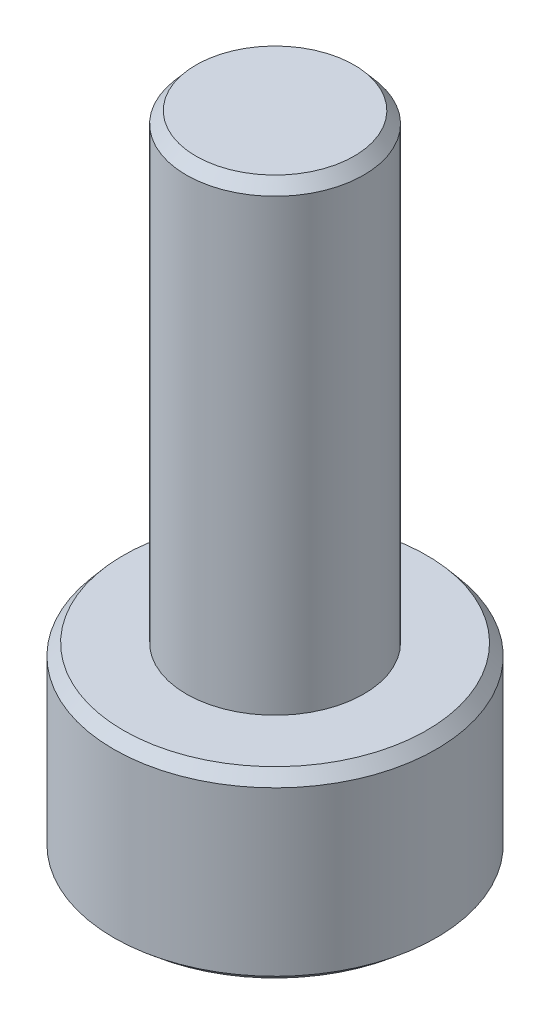
ISO-10303-21;
HEADER;
FILE_DESCRIPTION(('STEP AP214'),'2;1');
FILE_NAME('part.step','',(''),(''),'','','');
FILE_SCHEMA(('AUTOMOTIVE_DESIGN { 1 0 10303 214 1 1 1 1 }'));
ENDSEC;
DATA;
#1=APPLICATION_CONTEXT('core data for automotive mechanical design processes');
#2=APPLICATION_PROTOCOL_DEFINITION('international standard','automotive_design',2000,#1);
#3=PRODUCT_CONTEXT('',#1,'mechanical');
#4=PRODUCT('Part','Part','',(#3));
#5=PRODUCT_RELATED_PRODUCT_CATEGORY('part','',(#4));
#6=PRODUCT_DEFINITION_FORMATION('','',#4);
#7=PRODUCT_DEFINITION_CONTEXT('part definition',#1,'design');
#8=PRODUCT_DEFINITION('design','',#6,#7);
#9=PRODUCT_DEFINITION_SHAPE('','',#8);
#10=(LENGTH_UNIT() NAMED_UNIT(*) SI_UNIT(.MILLI.,.METRE.));
#11=(NAMED_UNIT(*) PLANE_ANGLE_UNIT() SI_UNIT($,.RADIAN.));
#12=(NAMED_UNIT(*) SI_UNIT($,.STERADIAN.) SOLID_ANGLE_UNIT());
#13=UNCERTAINTY_MEASURE_WITH_UNIT(LENGTH_MEASURE(1.E-05),#10,'distance_accuracy_value','');
#14=(GEOMETRIC_REPRESENTATION_CONTEXT(3) GLOBAL_UNCERTAINTY_ASSIGNED_CONTEXT((#13)) GLOBAL_UNIT_ASSIGNED_CONTEXT((#10,
#11,#12)) REPRESENTATION_CONTEXT('',''));
#15=CARTESIAN_POINT('',(0.,0.,0.));
#16=DIRECTION('',(0.,0.,1.));
#17=DIRECTION('',(1.,0.,0.));
#18=AXIS2_PLACEMENT_3D('',#15,#16,#17);
#19=CARTESIAN_POINT('',(0.,4.,0.));
#20=DIRECTION('',(0.,-1.,0.));
#21=DIRECTION('',(0.,0.,-1.));
#22=AXIS2_PLACEMENT_3D('',#19,#20,#21);
#23=CYLINDRICAL_SURFACE('',#22,3.5);
#24=CARTESIAN_POINT('',(0.,0.209774907794321,0.));
#25=DIRECTION('',(0.,1.,0.));
#26=DIRECTION('',(0.,0.,1.));
#27=AXIS2_PLACEMENT_3D('',#24,#25,#26);
#28=CIRCLE('',#27,3.5);
#29=CARTESIAN_POINT('',(0.,0.209774907794321,3.5));
#30=VERTEX_POINT('',#29);
#31=EDGE_CURVE('E203',#30,#30,#28,.T.);
#32=ORIENTED_EDGE('',*,*,#31,.T.);
#33=EDGE_LOOP('',(#32));
#34=FACE_BOUND('',#33,.T.);
#35=CARTESIAN_POINT('',(0.,3.75,0.));
#36=DIRECTION('',(0.,1.,0.));
#37=DIRECTION('',(0.,0.,1.));
#38=AXIS2_PLACEMENT_3D('',#35,#36,#37);
#39=CIRCLE('',#38,3.5);
#40=CARTESIAN_POINT('',(0.,3.75,3.5));
#41=VERTEX_POINT('',#40);
#42=EDGE_CURVE('E200',#41,#41,#39,.F.);
#43=ORIENTED_EDGE('',*,*,#42,.T.);
#44=EDGE_LOOP('',(#43));
#45=FACE_BOUND('',#44,.T.);
#46=ADVANCED_FACE('F45',(#34,#45),#23,.T.);
#47=CARTESIAN_POINT('',(0.,4.,0.));
#48=DIRECTION('',(0.,1.,0.));
#49=DIRECTION('',(0.,0.,1.));
#50=AXIS2_PLACEMENT_3D('',#47,#48,#49);
#51=PLANE('',#50);
#52=CARTESIAN_POINT('',(0.,4.,0.));
#53=DIRECTION('',(0.,1.,0.));
#54=DIRECTION('',(0.,0.,1.));
#55=AXIS2_PLACEMENT_3D('',#52,#53,#54);
#56=CIRCLE('',#55,3.29022509220568);
#57=CARTESIAN_POINT('',(0.,4.,3.29022509220568));
#58=VERTEX_POINT('',#57);
#59=EDGE_CURVE('E207',#58,#58,#56,.T.);
#60=ORIENTED_EDGE('',*,*,#59,.T.);
#61=EDGE_LOOP('',(#60));
#62=FACE_BOUND('',#61,.T.);
#63=CARTESIAN_POINT('',(0.,4.,0.));
#64=DIRECTION('',(0.,1.,0.));
#65=DIRECTION('',(0.,0.,1.));
#66=AXIS2_PLACEMENT_3D('',#63,#64,#65);
#67=CIRCLE('',#66,1.925);
#68=CARTESIAN_POINT('',(0.,4.,1.925));
#69=VERTEX_POINT('',#68);
#70=EDGE_CURVE('E155',#69,#69,#67,.T.);
#71=ORIENTED_EDGE('',*,*,#70,.F.);
#72=EDGE_LOOP('',(#71));
#73=FACE_BOUND('',#72,.T.);
#74=ADVANCED_FACE('F264',(#62,#73),#51,.T.);
#75=CARTESIAN_POINT('',(0.,0.,0.));
#76=DIRECTION('',(0.,1.,0.));
#77=DIRECTION('',(0.,0.,1.));
#78=AXIS2_PLACEMENT_3D('',#75,#76,#77);
#79=PLANE('',#78);
#80=DIRECTION('',(-0.866025403784442,0.,0.499999999999995));
#81=VECTOR('',#80,1.);
#82=CARTESIAN_POINT('',(-1.15206434767624,0.,-1.99543398376396));
#83=LINE('',#82,#81);
#84=CARTESIAN_POINT('',(0.,0.,-2.66057864501861));
#85=VERTEX_POINT('',#84);
#86=CARTESIAN_POINT('',(-2.30412869535249,0.,-1.33028932250932));
#87=VERTEX_POINT('',#86);
#88=EDGE_CURVE('E185',#85,#87,#83,.T.);
#89=ORIENTED_EDGE('',*,*,#88,.T.);
#90=DIRECTION('',(0.,0.,1.));
#91=VECTOR('',#90,1.);
#92=CARTESIAN_POINT('',(-2.30412869535249,0.,0.));
#93=LINE('',#92,#91);
#94=CARTESIAN_POINT('',(-2.3041286953525,0.,1.3302893225093));
#95=VERTEX_POINT('',#94);
#96=EDGE_CURVE('E187',#87,#95,#93,.T.);
#97=ORIENTED_EDGE('',*,*,#96,.T.);
#98=DIRECTION('',(0.866025403784438,0.,0.500000000000001));
#99=VECTOR('',#98,1.);
#100=CARTESIAN_POINT('',(-1.15206434767625,0.,1.99543398376395));
#101=LINE('',#100,#99);
#102=CARTESIAN_POINT('',(0.,0.,2.66057864501861));
#103=VERTEX_POINT('',#102);
#104=EDGE_CURVE('E175',#95,#103,#101,.T.);
#105=ORIENTED_EDGE('',*,*,#104,.T.);
#106=DIRECTION('',(0.866025403784442,0.,-0.499999999999995));
#107=VECTOR('',#106,1.);
#108=CARTESIAN_POINT('',(1.15206434767624,0.,1.99543398376397));
#109=LINE('',#108,#107);
#110=CARTESIAN_POINT('',(2.30412869535248,0.,1.33028932250933));
#111=VERTEX_POINT('',#110);
#112=EDGE_CURVE('E177',#103,#111,#109,.T.);
#113=ORIENTED_EDGE('',*,*,#112,.T.);
#114=DIRECTION('',(0.,0.,-1.));
#115=VECTOR('',#114,1.);
#116=CARTESIAN_POINT('',(2.30412869535249,0.,0.));
#117=LINE('',#116,#115);
#118=CARTESIAN_POINT('',(2.30412869535251,0.,-1.33028932250928));
#119=VERTEX_POINT('',#118);
#120=EDGE_CURVE('E180',#111,#119,#117,.T.);
#121=ORIENTED_EDGE('',*,*,#120,.T.);
#122=DIRECTION('',(-0.866025403784434,0.,-0.500000000000007));
#123=VECTOR('',#122,1.);
#124=CARTESIAN_POINT('',(1.15206434767626,0.,-1.99543398376395));
#125=LINE('',#124,#123);
#126=EDGE_CURVE('E183',#119,#85,#125,.T.);
#127=ORIENTED_EDGE('',*,*,#126,.T.);
#128=EDGE_LOOP('',(#89,#97,#105,#113,#121,#127));
#129=FACE_BOUND('',#128,.T.);
#130=CARTESIAN_POINT('',(0.,0.,0.));
#131=DIRECTION('',(0.,1.,0.));
#132=DIRECTION('',(0.,0.,1.));
#133=AXIS2_PLACEMENT_3D('',#130,#131,#132);
#134=CIRCLE('',#133,3.25);
#135=CARTESIAN_POINT('',(0.,0.,3.25));
#136=VERTEX_POINT('',#135);
#137=EDGE_CURVE('E171',#136,#136,#134,.F.);
#138=ORIENTED_EDGE('',*,*,#137,.T.);
#139=EDGE_LOOP('',(#138));
#140=FACE_BOUND('',#139,.T.);
#141=ADVANCED_FACE('F272',(#129,#140),#79,.F.);
#142=CARTESIAN_POINT('',(0.,14.,0.));
#143=DIRECTION('',(0.,-1.,0.));
#144=DIRECTION('',(0.,0.,-1.));
#145=AXIS2_PLACEMENT_3D('',#142,#143,#144);
#146=CYLINDRICAL_SURFACE('',#145,1.925);
#147=CARTESIAN_POINT('',(0.,13.75,0.));
#148=DIRECTION('',(0.,1.,0.));
#149=DIRECTION('',(0.,0.,1.));
#150=AXIS2_PLACEMENT_3D('',#147,#148,#149);
#151=CIRCLE('',#150,1.925);
#152=CARTESIAN_POINT('',(0.,13.75,1.925));
#153=VERTEX_POINT('',#152);
#154=EDGE_CURVE('E11',#153,#153,#151,.F.);
#155=ORIENTED_EDGE('',*,*,#154,.T.);
#156=EDGE_LOOP('',(#155));
#157=FACE_BOUND('',#156,.T.);
#158=ORIENTED_EDGE('',*,*,#70,.T.);
#159=EDGE_LOOP('',(#158));
#160=FACE_BOUND('',#159,.T.);
#161=ADVANCED_FACE('F335',(#157,#160),#146,.T.);
#162=CARTESIAN_POINT('',(0.,14.,0.));
#163=DIRECTION('',(0.,1.,0.));
#164=DIRECTION('',(0.,0.,1.));
#165=AXIS2_PLACEMENT_3D('',#162,#163,#164);
#166=PLANE('',#165);
#167=CARTESIAN_POINT('',(0.,14.,0.));
#168=DIRECTION('',(0.,1.,0.));
#169=DIRECTION('',(0.,0.,1.));
#170=AXIS2_PLACEMENT_3D('',#167,#168,#169);
#171=CIRCLE('',#170,1.71522509220568);
#172=CARTESIAN_POINT('',(0.,14.,1.71522509220568));
#173=VERTEX_POINT('',#172);
#174=EDGE_CURVE('E55',#173,#173,#171,.T.);
#175=ORIENTED_EDGE('',*,*,#174,.T.);
#176=EDGE_LOOP('',(#175));
#177=FACE_BOUND('',#176,.T.);
#178=ADVANCED_FACE('F260',(#177),#166,.T.);
#179=CARTESIAN_POINT('',(2.05412869535248,2.,1.18595175521192));
#180=DIRECTION('',(0.499999999999995,0.,0.866025403784441));
#181=DIRECTION('',(0.866025403784442,0.,-0.499999999999995));
#182=AXIS2_PLACEMENT_3D('',#179,#180,#181);
#183=PLANE('',#182);
#184=DIRECTION('',(0.,-1.,0.));
#185=VECTOR('',#184,1.);
#186=CARTESIAN_POINT('',(2.05412869535248,2.,1.18595175521192));
#187=LINE('',#186,#185);
#188=CARTESIAN_POINT('',(2.05412869535248,2.,1.18595175521192));
#189=VERTEX_POINT('',#188);
#190=CARTESIAN_POINT('',(2.05412869535248,0.209774907794322,1.18595175521192));
#191=VERTEX_POINT('',#190);
#192=EDGE_CURVE('E153',#189,#191,#187,.T.);
#193=ORIENTED_EDGE('',*,*,#192,.T.);
#194=DIRECTION('',(-0.866025403784442,0.,0.499999999999995));
#195=VECTOR('',#194,1.);
#196=CARTESIAN_POINT('',(2.05412869535248,0.209774907794322,1.18595175521192));
#197=LINE('',#196,#195);
#198=CARTESIAN_POINT('',(0.,0.209774907794322,2.37190351042379));
#199=VERTEX_POINT('',#198);
#200=EDGE_CURVE('E63',#191,#199,#197,.T.);
#201=ORIENTED_EDGE('',*,*,#200,.T.);
#202=DIRECTION('',(0.,-1.,0.));
#203=VECTOR('',#202,1.);
#204=CARTESIAN_POINT('',(0.,2.,2.37190351042379));
#205=LINE('',#204,#203);
#206=CARTESIAN_POINT('',(0.,2.,2.37190351042379));
#207=VERTEX_POINT('',#206);
#208=EDGE_CURVE('E118',#207,#199,#205,.T.);
#209=ORIENTED_EDGE('',*,*,#208,.F.);
#210=DIRECTION('',(-0.866025403784441,0.,0.499999999999995));
#211=VECTOR('',#210,1.);
#212=CARTESIAN_POINT('',(2.05412869535248,2.,1.18595175521192));
#213=LINE('',#212,#211);
#214=EDGE_CURVE('E122',#189,#207,#213,.T.);
#215=ORIENTED_EDGE('',*,*,#214,.F.);
#216=EDGE_LOOP('',(#193,#201,#209,#215));
#217=FACE_BOUND('',#216,.T.);
#218=ADVANCED_FACE('F120',(#217),#183,.F.);
#219=CARTESIAN_POINT('',(2.0541286953525,2.,-1.18595175521188));
#220=DIRECTION('',(1.,0.,0.));
#221=DIRECTION('',(0.,0.,-1.));
#222=AXIS2_PLACEMENT_3D('',#219,#220,#221);
#223=PLANE('',#222);
#224=DIRECTION('',(0.,-1.,0.));
#225=VECTOR('',#224,1.);
#226=CARTESIAN_POINT('',(2.0541286953525,2.,-1.18595175521188));
#227=LINE('',#226,#225);
#228=CARTESIAN_POINT('',(2.0541286953525,2.,-1.18595175521188));
#229=VERTEX_POINT('',#228);
#230=CARTESIAN_POINT('',(2.0541286953525,0.209774907794322,-1.18595175521188));
#231=VERTEX_POINT('',#230);
#232=EDGE_CURVE('E156',#229,#231,#227,.T.);
#233=ORIENTED_EDGE('',*,*,#232,.T.);
#234=DIRECTION('',(0.,0.,1.));
#235=VECTOR('',#234,1.);
#236=CARTESIAN_POINT('',(2.0541286953525,0.209774907794322,-1.18595175521188));
#237=LINE('',#236,#235);
#238=EDGE_CURVE('E71',#231,#191,#237,.T.);
#239=ORIENTED_EDGE('',*,*,#238,.T.);
#240=ORIENTED_EDGE('',*,*,#192,.F.);
#241=DIRECTION('',(0.,0.,1.));
#242=VECTOR('',#241,1.);
#243=CARTESIAN_POINT('',(2.0541286953525,2.,-1.18595175521188));
#244=LINE('',#243,#242);
#245=EDGE_CURVE('E127',#229,#189,#244,.T.);
#246=ORIENTED_EDGE('',*,*,#245,.F.);
#247=EDGE_LOOP('',(#233,#239,#240,#246));
#248=FACE_BOUND('',#247,.T.);
#249=ADVANCED_FACE('F252',(#248),#223,.F.);
#250=CARTESIAN_POINT('',(0.,2.,-2.37190351042379));
#251=DIRECTION('',(0.500000000000007,0.,-0.866025403784435));
#252=DIRECTION('',(-0.866025403784435,0.,-0.500000000000007));
#253=AXIS2_PLACEMENT_3D('',#250,#251,#252);
#254=PLANE('',#253);
#255=DIRECTION('',(0.,-1.,0.));
#256=VECTOR('',#255,1.);
#257=CARTESIAN_POINT('',(0.,2.,-2.37190351042379));
#258=LINE('',#257,#256);
#259=CARTESIAN_POINT('',(0.,2.,-2.37190351042379));
#260=VERTEX_POINT('',#259);
#261=CARTESIAN_POINT('',(0.,0.209774907794322,-2.37190351042379));
#262=VERTEX_POINT('',#261);
#263=EDGE_CURVE('E158',#260,#262,#258,.T.);
#264=ORIENTED_EDGE('',*,*,#263,.T.);
#265=DIRECTION('',(0.866025403784435,0.,0.500000000000007));
#266=VECTOR('',#265,1.);
#267=CARTESIAN_POINT('',(0.,0.209774907794322,-2.37190351042379));
#268=LINE('',#267,#266);
#269=EDGE_CURVE('E193',#262,#231,#268,.T.);
#270=ORIENTED_EDGE('',*,*,#269,.T.);
#271=ORIENTED_EDGE('',*,*,#232,.F.);
#272=DIRECTION('',(0.866025403784435,0.,0.500000000000007));
#273=VECTOR('',#272,1.);
#274=CARTESIAN_POINT('',(0.,2.,-2.37190351042379));
#275=LINE('',#274,#273);
#276=EDGE_CURVE('E149',#260,#229,#275,.T.);
#277=ORIENTED_EDGE('',*,*,#276,.F.);
#278=EDGE_LOOP('',(#264,#270,#271,#277));
#279=FACE_BOUND('',#278,.T.);
#280=ADVANCED_FACE('F251',(#279),#254,.F.);
#281=CARTESIAN_POINT('',(-2.05412869535249,2.,-1.18595175521191));
#282=DIRECTION('',(-0.499999999999995,0.,-0.866025403784442));
#283=DIRECTION('',(-0.866025403784442,0.,0.499999999999995));
#284=AXIS2_PLACEMENT_3D('',#281,#282,#283);
#285=PLANE('',#284);
#286=DIRECTION('',(0.,-1.,0.));
#287=VECTOR('',#286,1.);
#288=CARTESIAN_POINT('',(-2.05412869535249,2.,-1.18595175521191));
#289=LINE('',#288,#287);
#290=CARTESIAN_POINT('',(-2.05412869535249,2.,-1.18595175521191));
#291=VERTEX_POINT('',#290);
#292=CARTESIAN_POINT('',(-2.05412869535249,0.209774907794322,-1.18595175521191));
#293=VERTEX_POINT('',#292);
#294=EDGE_CURVE('E161',#291,#293,#289,.T.);
#295=ORIENTED_EDGE('',*,*,#294,.T.);
#296=DIRECTION('',(0.866025403784442,0.,-0.499999999999995));
#297=VECTOR('',#296,1.);
#298=CARTESIAN_POINT('',(-2.05412869535249,0.209774907794322,-1.18595175521191));
#299=LINE('',#298,#297);
#300=EDGE_CURVE('E191',#293,#262,#299,.T.);
#301=ORIENTED_EDGE('',*,*,#300,.T.);
#302=ORIENTED_EDGE('',*,*,#263,.F.);
#303=DIRECTION('',(0.866025403784442,0.,-0.499999999999995));
#304=VECTOR('',#303,1.);
#305=CARTESIAN_POINT('',(-2.05412869535249,2.,-1.18595175521191));
#306=LINE('',#305,#304);
#307=EDGE_CURVE('E146',#291,#260,#306,.T.);
#308=ORIENTED_EDGE('',*,*,#307,.F.);
#309=EDGE_LOOP('',(#295,#301,#302,#308));
#310=FACE_BOUND('',#309,.T.);
#311=ADVANCED_FACE('F248',(#310),#285,.F.);
#312=CARTESIAN_POINT('',(-2.0541286953525,2.,1.18595175521189));
#313=DIRECTION('',(-1.,0.,0.));
#314=DIRECTION('',(0.,0.,1.));
#315=AXIS2_PLACEMENT_3D('',#312,#313,#314);
#316=PLANE('',#315);
#317=DIRECTION('',(0.,-1.,0.));
#318=VECTOR('',#317,1.);
#319=CARTESIAN_POINT('',(-2.0541286953525,2.,1.18595175521189));
#320=LINE('',#319,#318);
#321=CARTESIAN_POINT('',(-2.0541286953525,2.,1.18595175521189));
#322=VERTEX_POINT('',#321);
#323=CARTESIAN_POINT('',(-2.0541286953525,0.209774907794322,1.18595175521189));
#324=VERTEX_POINT('',#323);
#325=EDGE_CURVE('E126',#322,#324,#320,.T.);
#326=ORIENTED_EDGE('',*,*,#325,.T.);
#327=DIRECTION('',(0.,0.,-1.));
#328=VECTOR('',#327,1.);
#329=CARTESIAN_POINT('',(-2.0541286953525,0.209774907794322,1.18595175521189));
#330=LINE('',#329,#328);
#331=EDGE_CURVE('E168',#324,#293,#330,.T.);
#332=ORIENTED_EDGE('',*,*,#331,.T.);
#333=ORIENTED_EDGE('',*,*,#294,.F.);
#334=DIRECTION('',(0.,0.,-1.));
#335=VECTOR('',#334,1.);
#336=CARTESIAN_POINT('',(-2.0541286953525,2.,1.18595175521189));
#337=LINE('',#336,#335);
#338=EDGE_CURVE('E136',#322,#291,#337,.T.);
#339=ORIENTED_EDGE('',*,*,#338,.F.);
#340=EDGE_LOOP('',(#326,#332,#333,#339));
#341=FACE_BOUND('',#340,.T.);
#342=ADVANCED_FACE('F244',(#341),#316,.F.);
#343=CARTESIAN_POINT('',(0.,2.,2.37190351042379));
#344=DIRECTION('',(-0.500000000000001,0.,0.866025403784438));
#345=DIRECTION('',(0.866025403784438,0.,0.500000000000001));
#346=AXIS2_PLACEMENT_3D('',#343,#344,#345);
#347=PLANE('',#346);
#348=ORIENTED_EDGE('',*,*,#208,.T.);
#349=DIRECTION('',(-0.866025403784438,0.,-0.500000000000001));
#350=VECTOR('',#349,1.);
#351=CARTESIAN_POINT('',(0.,0.209774907794322,2.37190351042379));
#352=LINE('',#351,#350);
#353=EDGE_CURVE('E198',#199,#324,#352,.T.);
#354=ORIENTED_EDGE('',*,*,#353,.T.);
#355=ORIENTED_EDGE('',*,*,#325,.F.);
#356=DIRECTION('',(-0.866025403784438,0.,-0.500000000000001));
#357=VECTOR('',#356,1.);
#358=CARTESIAN_POINT('',(0.,2.,2.37190351042379));
#359=LINE('',#358,#357);
#360=EDGE_CURVE('E130',#207,#322,#359,.T.);
#361=ORIENTED_EDGE('',*,*,#360,.F.);
#362=EDGE_LOOP('',(#348,#354,#355,#361));
#363=FACE_BOUND('',#362,.T.);
#364=ADVANCED_FACE('F131',(#363),#347,.F.);
#365=CARTESIAN_POINT('',(0.,2.,0.));
#366=DIRECTION('',(0.,-1.,0.));
#367=DIRECTION('',(0.,0.,-1.));
#368=AXIS2_PLACEMENT_3D('',#365,#366,#367);
#369=PLANE('',#368);
#370=ORIENTED_EDGE('',*,*,#214,.T.);
#371=ORIENTED_EDGE('',*,*,#360,.T.);
#372=ORIENTED_EDGE('',*,*,#338,.T.);
#373=ORIENTED_EDGE('',*,*,#307,.T.);
#374=ORIENTED_EDGE('',*,*,#276,.T.);
#375=ORIENTED_EDGE('',*,*,#245,.T.);
#376=EDGE_LOOP('',(#370,#371,#372,#373,#374,#375));
#377=FACE_BOUND('',#376,.T.);
#378=ADVANCED_FACE('F138',(#377),#369,.T.);
#379=CARTESIAN_POINT('',(2.0541286953525,0.209774907794322,-1.18595175521188));
#380=DIRECTION('',(0.64278760968654,0.766044443118978,0.));
#381=DIRECTION('',(0.,0.,1.));
#382=AXIS2_PLACEMENT_3D('',#379,#380,#381);
#383=PLANE('',#382);
#384=DIRECTION('',(0.700582935935481,-0.587858883152555,-0.404481746651999));
#385=VECTOR('',#384,1.);
#386=CARTESIAN_POINT('',(1.3819952591187,0.773761826240023,-0.79789533487095));
#387=LINE('',#386,#385);
#388=EDGE_CURVE('E143',#119,#231,#387,.F.);
#389=ORIENTED_EDGE('',*,*,#388,.F.);
#390=ORIENTED_EDGE('',*,*,#120,.F.);
#391=DIRECTION('',(0.700582935935474,-0.587858883152556,0.40448174665201));
#392=VECTOR('',#391,1.);
#393=CARTESIAN_POINT('',(1.38199525911869,0.773761826240018,0.797895334870987));
#394=LINE('',#393,#392);
#395=EDGE_CURVE('E50',#191,#111,#394,.T.);
#396=ORIENTED_EDGE('',*,*,#395,.F.);
#397=ORIENTED_EDGE('',*,*,#238,.F.);
#398=EDGE_LOOP('',(#389,#390,#396,#397));
#399=FACE_BOUND('',#398,.T.);
#400=ADVANCED_FACE('F232',(#399),#383,.F.);
#401=CARTESIAN_POINT('',(2.05412869535248,0.209774907794322,1.18595175521192));
#402=DIRECTION('',(0.321393804843267,0.766044443118977,0.556670399226422));
#403=DIRECTION('',(-0.866025403784442,0.,0.499999999999995));
#404=AXIS2_PLACEMENT_3D('',#401,#402,#403);
#405=PLANE('',#404);
#406=ORIENTED_EDGE('',*,*,#395,.T.);
#407=ORIENTED_EDGE('',*,*,#112,.F.);
#408=DIRECTION('',(0.,-0.587858883152556,0.808963493304011));
#409=VECTOR('',#408,1.);
#410=CARTESIAN_POINT('',(0.,0.773761826240015,1.59579066974194));
#411=LINE('',#410,#409);
#412=EDGE_CURVE('E221',#199,#103,#411,.T.);
#413=ORIENTED_EDGE('',*,*,#412,.F.);
#414=ORIENTED_EDGE('',*,*,#200,.F.);
#415=EDGE_LOOP('',(#406,#407,#413,#414));
#416=FACE_BOUND('',#415,.T.);
#417=ADVANCED_FACE('F236',(#416),#405,.F.);
#418=CARTESIAN_POINT('',(0.,0.209774907794322,-2.37190351042379));
#419=DIRECTION('',(0.321393804843275,0.766044443118978,-0.556670399226417));
#420=DIRECTION('',(0.866025403784435,0.,0.500000000000007));
#421=AXIS2_PLACEMENT_3D('',#418,#419,#420);
#422=PLANE('',#421);
#423=ORIENTED_EDGE('',*,*,#388,.T.);
#424=ORIENTED_EDGE('',*,*,#269,.F.);
#425=DIRECTION('',(0.,-0.587858883152555,-0.808963493304012));
#426=VECTOR('',#425,1.);
#427=CARTESIAN_POINT('',(0.,0.773761826240024,-1.59579066974193));
#428=LINE('',#427,#426);
#429=EDGE_CURVE('E218',#85,#262,#428,.F.);
#430=ORIENTED_EDGE('',*,*,#429,.F.);
#431=ORIENTED_EDGE('',*,*,#126,.F.);
#432=EDGE_LOOP('',(#423,#424,#430,#431));
#433=FACE_BOUND('',#432,.T.);
#434=ADVANCED_FACE('F228',(#433),#422,.F.);
#435=CARTESIAN_POINT('',(0.,0.209774907794322,2.37190351042379));
#436=DIRECTION('',(-0.321393804843271,0.766044443118978,0.556670399226419));
#437=DIRECTION('',(-0.866025403784438,0.,-0.500000000000001));
#438=AXIS2_PLACEMENT_3D('',#435,#436,#437);
#439=PLANE('',#438);
#440=ORIENTED_EDGE('',*,*,#412,.T.);
#441=ORIENTED_EDGE('',*,*,#104,.F.);
#442=DIRECTION('',(0.700582935935478,0.587858883152556,-0.404481746652005));
#443=VECTOR('',#442,1.);
#444=CARTESIAN_POINT('',(-2.0541286953525,0.209774907794322,1.18595175521189));
#445=LINE('',#444,#443);
#446=EDGE_CURVE('E216',#324,#95,#445,.F.);
#447=ORIENTED_EDGE('',*,*,#446,.F.);
#448=ORIENTED_EDGE('',*,*,#353,.F.);
#449=EDGE_LOOP('',(#440,#441,#447,#448));
#450=FACE_BOUND('',#449,.T.);
#451=ADVANCED_FACE('F241',(#450),#439,.F.);
#452=CARTESIAN_POINT('',(-2.05412869535249,0.209774907794322,-1.18595175521191));
#453=DIRECTION('',(-0.321393804843267,0.766044443118977,-0.556670399226422));
#454=DIRECTION('',(0.866025403784442,0.,-0.499999999999995));
#455=AXIS2_PLACEMENT_3D('',#452,#453,#454);
#456=PLANE('',#455);
#457=ORIENTED_EDGE('',*,*,#429,.T.);
#458=ORIENTED_EDGE('',*,*,#300,.F.);
#459=DIRECTION('',(-0.700582935935475,-0.587858883152556,-0.404481746652009));
#460=VECTOR('',#459,1.);
#461=CARTESIAN_POINT('',(-1.38199525911869,0.773761826240023,-0.79789533487097));
#462=LINE('',#461,#460);
#463=EDGE_CURVE('E214',#87,#293,#462,.F.);
#464=ORIENTED_EDGE('',*,*,#463,.F.);
#465=ORIENTED_EDGE('',*,*,#88,.F.);
#466=EDGE_LOOP('',(#457,#458,#464,#465));
#467=FACE_BOUND('',#466,.T.);
#468=ADVANCED_FACE('F287',(#467),#456,.F.);
#469=CARTESIAN_POINT('',(-2.0541286953525,0.209774907794322,1.18595175521189));
#470=DIRECTION('',(-0.64278760968654,0.766044443118977,0.));
#471=DIRECTION('',(0.,0.,-1.));
#472=AXIS2_PLACEMENT_3D('',#469,#470,#471);
#473=PLANE('',#472);
#474=ORIENTED_EDGE('',*,*,#446,.T.);
#475=ORIENTED_EDGE('',*,*,#96,.F.);
#476=ORIENTED_EDGE('',*,*,#463,.T.);
#477=ORIENTED_EDGE('',*,*,#331,.F.);
#478=EDGE_LOOP('',(#474,#475,#476,#477));
#479=FACE_BOUND('',#478,.T.);
#480=ADVANCED_FACE('F279',(#479),#473,.F.);
#481=CARTESIAN_POINT('',(0.,0.209774907794321,0.));
#482=DIRECTION('',(0.,1.,0.));
#483=DIRECTION('',(0.,0.,1.));
#484=AXIS2_PLACEMENT_3D('',#481,#482,#483);
#485=CONICAL_SURFACE('',#484,3.5,0.872664625997164);
#486=ORIENTED_EDGE('',*,*,#137,.F.);
#487=EDGE_LOOP('',(#486));
#488=FACE_BOUND('',#487,.T.);
#489=ORIENTED_EDGE('',*,*,#31,.F.);
#490=EDGE_LOOP('',(#489));
#491=FACE_BOUND('',#490,.T.);
#492=ADVANCED_FACE('F286',(#488,#491),#485,.T.);
#493=CARTESIAN_POINT('',(0.,4.,0.));
#494=DIRECTION('',(0.,-1.,0.));
#495=DIRECTION('',(0.,0.,-1.));
#496=AXIS2_PLACEMENT_3D('',#493,#494,#495);
#497=CONICAL_SURFACE('',#496,3.29022509220568,0.698131700797728);
#498=ORIENTED_EDGE('',*,*,#42,.F.);
#499=EDGE_LOOP('',(#498));
#500=FACE_BOUND('',#499,.T.);
#501=ORIENTED_EDGE('',*,*,#59,.F.);
#502=EDGE_LOOP('',(#501));
#503=FACE_BOUND('',#502,.T.);
#504=ADVANCED_FACE('F318',(#500,#503),#497,.T.);
#505=CARTESIAN_POINT('',(0.,14.,0.));
#506=DIRECTION('',(0.,-1.,0.));
#507=DIRECTION('',(0.,0.,-1.));
#508=AXIS2_PLACEMENT_3D('',#505,#506,#507);
#509=CONICAL_SURFACE('',#508,1.71522509220568,0.698131700797732);
#510=ORIENTED_EDGE('',*,*,#154,.F.);
#511=EDGE_LOOP('',(#510));
#512=FACE_BOUND('',#511,.T.);
#513=ORIENTED_EDGE('',*,*,#174,.F.);
#514=EDGE_LOOP('',(#513));
#515=FACE_BOUND('',#514,.T.);
#516=ADVANCED_FACE('F48',(#512,#515),#509,.T.);
#517=CLOSED_SHELL('',(#46,#74,#141,#161,#178,#218,#249,#280,#311,#342,#364,#378,#400,#417,#434,
#451,#468,#480,#492,#504,#516));
#518=MANIFOLD_SOLID_BREP('B2',#517);
#519=ADVANCED_BREP_SHAPE_REPRESENTATION('',(#18,#518),#14);
#520=SHAPE_DEFINITION_REPRESENTATION(#9,#519);
ENDSEC;
END-ISO-10303-21;
